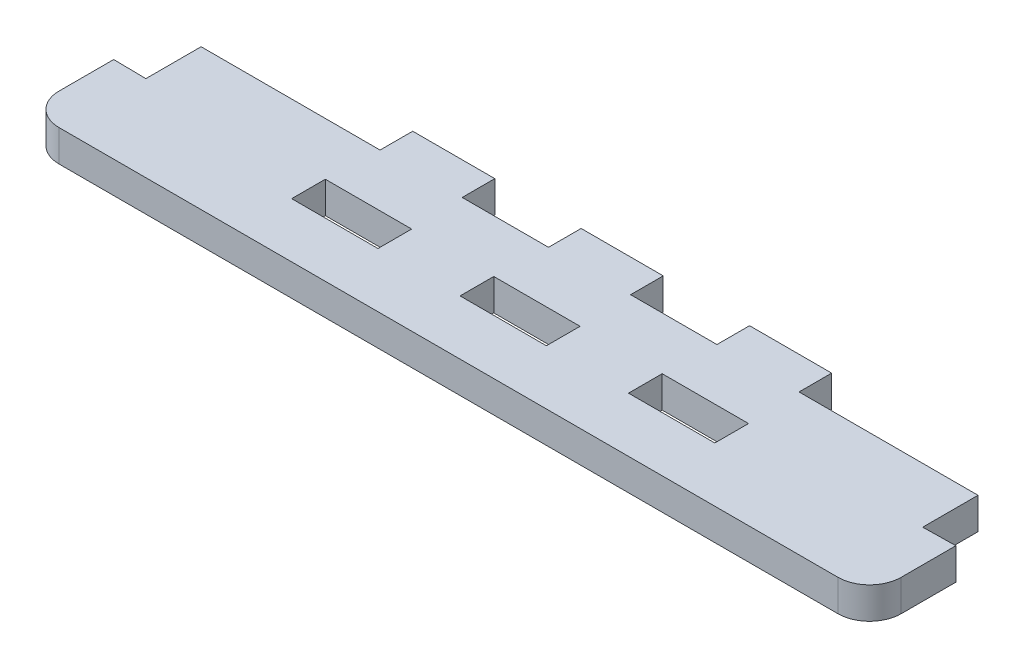
ISO-10303-21;
HEADER;
FILE_DESCRIPTION(('STEP AP214'),'2;1');
FILE_NAME('part.step','',(''),(''),'','','');
FILE_SCHEMA(('AUTOMOTIVE_DESIGN { 1 0 10303 214 1 1 1 1 }'));
ENDSEC;
DATA;
#1=APPLICATION_CONTEXT('core data for automotive mechanical design processes');
#2=APPLICATION_PROTOCOL_DEFINITION('international standard','automotive_design',2000,#1);
#3=PRODUCT_CONTEXT('',#1,'mechanical');
#4=PRODUCT('Part','Part','',(#3));
#5=PRODUCT_RELATED_PRODUCT_CATEGORY('part','',(#4));
#6=PRODUCT_DEFINITION_FORMATION('','',#4);
#7=PRODUCT_DEFINITION_CONTEXT('part definition',#1,'design');
#8=PRODUCT_DEFINITION('design','',#6,#7);
#9=PRODUCT_DEFINITION_SHAPE('','',#8);
#10=(LENGTH_UNIT() NAMED_UNIT(*) SI_UNIT(.MILLI.,.METRE.));
#11=(NAMED_UNIT(*) PLANE_ANGLE_UNIT() SI_UNIT($,.RADIAN.));
#12=(NAMED_UNIT(*) SI_UNIT($,.STERADIAN.) SOLID_ANGLE_UNIT());
#13=UNCERTAINTY_MEASURE_WITH_UNIT(LENGTH_MEASURE(1.E-05),#10,'distance_accuracy_value','');
#14=(GEOMETRIC_REPRESENTATION_CONTEXT(3) GLOBAL_UNCERTAINTY_ASSIGNED_CONTEXT((#13)) GLOBAL_UNIT_ASSIGNED_CONTEXT((#10,
#11,#12)) REPRESENTATION_CONTEXT('',''));
#15=CARTESIAN_POINT('',(0.,0.,0.));
#16=DIRECTION('',(0.,0.,1.));
#17=DIRECTION('',(1.,0.,0.));
#18=AXIS2_PLACEMENT_3D('',#15,#16,#17);
#19=CARTESIAN_POINT('',(0.,-3.,0.));
#20=DIRECTION('',(0.,0.,-1.));
#21=DIRECTION('',(-1.,0.,0.));
#22=AXIS2_PLACEMENT_3D('',#19,#20,#21);
#23=PLANE('',#22);
#24=DIRECTION('',(0.,1.,0.));
#25=VECTOR('',#24,1.);
#26=CARTESIAN_POINT('',(59.9000000000001,-3.,0.));
#27=LINE('',#26,#25);
#28=CARTESIAN_POINT('',(59.9000000000001,-3.,0.));
#29=VERTEX_POINT('',#28);
#30=CARTESIAN_POINT('',(59.9000000000001,0.,0.));
#31=VERTEX_POINT('',#30);
#32=EDGE_CURVE('E330',#29,#31,#27,.T.);
#33=ORIENTED_EDGE('',*,*,#32,.F.);
#34=DIRECTION('',(-1.,0.,0.));
#35=VECTOR('',#34,1.);
#36=CARTESIAN_POINT('',(0.,-3.,0.));
#37=LINE('',#36,#35);
#38=CARTESIAN_POINT('',(52.1000000000001,-3.,0.));
#39=VERTEX_POINT('',#38);
#40=EDGE_CURVE('E487',#29,#39,#37,.T.);
#41=ORIENTED_EDGE('',*,*,#40,.T.);
#42=DIRECTION('',(0.,-1.,0.));
#43=VECTOR('',#42,1.);
#44=CARTESIAN_POINT('',(52.1000000000001,-3.,0.));
#45=LINE('',#44,#43);
#46=CARTESIAN_POINT('',(52.1000000000001,0.,0.));
#47=VERTEX_POINT('',#46);
#48=EDGE_CURVE('E354',#47,#39,#45,.T.);
#49=ORIENTED_EDGE('',*,*,#48,.F.);
#50=DIRECTION('',(-1.,0.,0.));
#51=VECTOR('',#50,1.);
#52=CARTESIAN_POINT('',(0.,0.,0.));
#53=LINE('',#52,#51);
#54=EDGE_CURVE('E481',#31,#47,#53,.T.);
#55=ORIENTED_EDGE('',*,*,#54,.F.);
#56=EDGE_LOOP('',(#33,#41,#49,#55));
#57=FACE_BOUND('',#56,.T.);
#58=ADVANCED_FACE('F33',(#57),#23,.T.);
#59=DIRECTION('',(0.,1.,0.));
#60=VECTOR('',#59,1.);
#61=CARTESIAN_POINT('',(43.9,-3.,0.));
#62=LINE('',#61,#60);
#63=CARTESIAN_POINT('',(43.9,-3.,0.));
#64=VERTEX_POINT('',#63);
#65=CARTESIAN_POINT('',(43.9,0.,0.));
#66=VERTEX_POINT('',#65);
#67=EDGE_CURVE('E350',#64,#66,#62,.T.);
#68=ORIENTED_EDGE('',*,*,#67,.F.);
#69=CARTESIAN_POINT('',(36.1,-3.,0.));
#70=VERTEX_POINT('',#69);
#71=EDGE_CURVE('E490',#64,#70,#37,.T.);
#72=ORIENTED_EDGE('',*,*,#71,.T.);
#73=DIRECTION('',(0.,-1.,0.));
#74=VECTOR('',#73,1.);
#75=CARTESIAN_POINT('',(36.1,-3.,0.));
#76=LINE('',#75,#74);
#77=CARTESIAN_POINT('',(36.1,0.,0.));
#78=VERTEX_POINT('',#77);
#79=EDGE_CURVE('E411',#78,#70,#76,.T.);
#80=ORIENTED_EDGE('',*,*,#79,.F.);
#81=EDGE_CURVE('E500',#66,#78,#53,.T.);
#82=ORIENTED_EDGE('',*,*,#81,.F.);
#83=EDGE_LOOP('',(#68,#72,#80,#82));
#84=FACE_BOUND('',#83,.T.);
#85=ADVANCED_FACE('F565',(#84),#23,.T.);
#86=CARTESIAN_POINT('',(0.,-3.,0.));
#87=DIRECTION('',(-1.,0.,0.));
#88=DIRECTION('',(0.,0.,1.));
#89=AXIS2_PLACEMENT_3D('',#86,#87,#88);
#90=PLANE('',#89);
#91=DIRECTION('',(0.,0.,1.));
#92=VECTOR('',#91,1.);
#93=CARTESIAN_POINT('',(0.,-3.,0.));
#94=LINE('',#93,#92);
#95=CARTESIAN_POINT('',(0.,-3.,8.30001388792448));
#96=VERTEX_POINT('',#95);
#97=CARTESIAN_POINT('',(0.,-3.,13.5));
#98=VERTEX_POINT('',#97);
#99=EDGE_CURVE('E279',#96,#98,#94,.T.);
#100=ORIENTED_EDGE('',*,*,#99,.T.);
#101=DIRECTION('',(0.,1.,0.));
#102=VECTOR('',#101,1.);
#103=CARTESIAN_POINT('',(0.,-3.,13.5));
#104=LINE('',#103,#102);
#105=CARTESIAN_POINT('',(0.,0.,13.5));
#106=VERTEX_POINT('',#105);
#107=EDGE_CURVE('E11',#98,#106,#104,.T.);
#108=ORIENTED_EDGE('',*,*,#107,.T.);
#109=DIRECTION('',(0.,0.,1.));
#110=VECTOR('',#109,1.);
#111=CARTESIAN_POINT('',(0.,0.,0.));
#112=LINE('',#111,#110);
#113=CARTESIAN_POINT('',(0.,0.,8.30001388792448));
#114=VERTEX_POINT('',#113);
#115=EDGE_CURVE('E472',#114,#106,#112,.T.);
#116=ORIENTED_EDGE('',*,*,#115,.F.);
#117=DIRECTION('',(0.,1.,0.));
#118=VECTOR('',#117,1.);
#119=CARTESIAN_POINT('',(0.,-3.,8.30001388792448));
#120=LINE('',#119,#118);
#121=EDGE_CURVE('E294',#96,#114,#120,.T.);
#122=ORIENTED_EDGE('',*,*,#121,.F.);
#123=EDGE_LOOP('',(#100,#108,#116,#122));
#124=FACE_BOUND('',#123,.T.);
#125=ADVANCED_FACE('F608',(#124),#90,.T.);
#126=DIRECTION('',(0.,-1.,0.));
#127=VECTOR('',#126,1.);
#128=CARTESIAN_POINT('',(20.1,-3.,0.));
#129=LINE('',#128,#127);
#130=CARTESIAN_POINT('',(20.1,0.,0.));
#131=VERTEX_POINT('',#130);
#132=CARTESIAN_POINT('',(20.1,-3.,0.));
#133=VERTEX_POINT('',#132);
#134=EDGE_CURVE('E297',#131,#133,#129,.T.);
#135=ORIENTED_EDGE('',*,*,#134,.F.);
#136=CARTESIAN_POINT('',(27.9,0.,0.));
#137=VERTEX_POINT('',#136);
#138=EDGE_CURVE('E498',#137,#131,#53,.T.);
#139=ORIENTED_EDGE('',*,*,#138,.F.);
#140=DIRECTION('',(0.,1.,0.));
#141=VECTOR('',#140,1.);
#142=CARTESIAN_POINT('',(27.9,-3.,0.));
#143=LINE('',#142,#141);
#144=CARTESIAN_POINT('',(27.9,-3.,0.));
#145=VERTEX_POINT('',#144);
#146=EDGE_CURVE('E407',#145,#137,#143,.T.);
#147=ORIENTED_EDGE('',*,*,#146,.F.);
#148=EDGE_CURVE('E486',#145,#133,#37,.T.);
#149=ORIENTED_EDGE('',*,*,#148,.T.);
#150=EDGE_LOOP('',(#135,#139,#147,#149));
#151=FACE_BOUND('',#150,.T.);
#152=ADVANCED_FACE('F573',(#151),#23,.T.);
#153=CARTESIAN_POINT('',(80.,-3.,0.));
#154=DIRECTION('',(1.,0.,0.));
#155=DIRECTION('',(0.,0.,-1.));
#156=AXIS2_PLACEMENT_3D('',#153,#154,#155);
#157=PLANE('',#156);
#158=DIRECTION('',(0.,0.,-1.));
#159=VECTOR('',#158,1.);
#160=CARTESIAN_POINT('',(80.,0.,0.));
#161=LINE('',#160,#159);
#162=CARTESIAN_POINT('',(80.,0.,13.5));
#163=VERTEX_POINT('',#162);
#164=CARTESIAN_POINT('',(80.,0.,8.30001388792448));
#165=VERTEX_POINT('',#164);
#166=EDGE_CURVE('E496',#163,#165,#161,.T.);
#167=ORIENTED_EDGE('',*,*,#166,.F.);
#168=DIRECTION('',(0.,1.,0.));
#169=VECTOR('',#168,1.);
#170=CARTESIAN_POINT('',(80.,-3.,13.5));
#171=LINE('',#170,#169);
#172=CARTESIAN_POINT('',(80.,-3.,13.5));
#173=VERTEX_POINT('',#172);
#174=EDGE_CURVE('E56',#163,#173,#171,.F.);
#175=ORIENTED_EDGE('',*,*,#174,.T.);
#176=DIRECTION('',(0.,0.,-1.));
#177=VECTOR('',#176,1.);
#178=CARTESIAN_POINT('',(80.,-3.,0.));
#179=LINE('',#178,#177);
#180=CARTESIAN_POINT('',(80.,-3.,8.30001388792448));
#181=VERTEX_POINT('',#180);
#182=EDGE_CURVE('E484',#173,#181,#179,.T.);
#183=ORIENTED_EDGE('',*,*,#182,.T.);
#184=DIRECTION('',(0.,-1.,0.));
#185=VECTOR('',#184,1.);
#186=CARTESIAN_POINT('',(80.,-3.,8.30001388792448));
#187=LINE('',#186,#185);
#188=EDGE_CURVE('E323',#165,#181,#187,.T.);
#189=ORIENTED_EDGE('',*,*,#188,.F.);
#190=EDGE_LOOP('',(#167,#175,#183,#189));
#191=FACE_BOUND('',#190,.T.);
#192=ADVANCED_FACE('F530',(#191),#157,.T.);
#193=CARTESIAN_POINT('',(0.,-3.,16.5));
#194=DIRECTION('',(0.,0.,1.));
#195=DIRECTION('',(1.,0.,0.));
#196=AXIS2_PLACEMENT_3D('',#193,#194,#195);
#197=PLANE('',#196);
#198=DIRECTION('',(1.,0.,0.));
#199=VECTOR('',#198,1.);
#200=CARTESIAN_POINT('',(0.,-3.,16.5));
#201=LINE('',#200,#199);
#202=CARTESIAN_POINT('',(3.,-3.,16.5));
#203=VERTEX_POINT('',#202);
#204=CARTESIAN_POINT('',(77.,-3.,16.5));
#205=VERTEX_POINT('',#204);
#206=EDGE_CURVE('E480',#203,#205,#201,.T.);
#207=ORIENTED_EDGE('',*,*,#206,.T.);
#208=DIRECTION('',(0.,1.,0.));
#209=VECTOR('',#208,1.);
#210=CARTESIAN_POINT('',(77.,-3.,16.5));
#211=LINE('',#210,#209);
#212=CARTESIAN_POINT('',(77.,0.,16.5));
#213=VERTEX_POINT('',#212);
#214=EDGE_CURVE('E509',#205,#213,#211,.T.);
#215=ORIENTED_EDGE('',*,*,#214,.T.);
#216=DIRECTION('',(1.,0.,0.));
#217=VECTOR('',#216,1.);
#218=CARTESIAN_POINT('',(0.,0.,16.5));
#219=LINE('',#218,#217);
#220=CARTESIAN_POINT('',(3.,0.,16.5));
#221=VERTEX_POINT('',#220);
#222=EDGE_CURVE('E493',#221,#213,#219,.T.);
#223=ORIENTED_EDGE('',*,*,#222,.F.);
#224=DIRECTION('',(0.,1.,0.));
#225=VECTOR('',#224,1.);
#226=CARTESIAN_POINT('',(3.,-3.,16.5));
#227=LINE('',#226,#225);
#228=EDGE_CURVE('E507',#221,#203,#227,.F.);
#229=ORIENTED_EDGE('',*,*,#228,.T.);
#230=EDGE_LOOP('',(#207,#215,#223,#229));
#231=FACE_BOUND('',#230,.T.);
#232=ADVANCED_FACE('F521',(#231),#197,.T.);
#233=CARTESIAN_POINT('',(0.,-3.,0.));
#234=DIRECTION('',(0.,1.,0.));
#235=DIRECTION('',(0.,0.,1.));
#236=AXIS2_PLACEMENT_3D('',#233,#234,#235);
#237=PLANE('',#236);
#238=ORIENTED_EDGE('',*,*,#182,.F.);
#239=CARTESIAN_POINT('',(77.,-3.,13.5));
#240=DIRECTION('',(0.,1.,0.));
#241=DIRECTION('',(0.,0.,1.));
#242=AXIS2_PLACEMENT_3D('',#239,#240,#241);
#243=CIRCLE('',#242,3.);
#244=EDGE_CURVE('E41',#173,#205,#243,.F.);
#245=ORIENTED_EDGE('',*,*,#244,.T.);
#246=ORIENTED_EDGE('',*,*,#206,.F.);
#247=CARTESIAN_POINT('',(3.,-3.,13.5));
#248=DIRECTION('',(0.,1.,0.));
#249=DIRECTION('',(0.,0.,1.));
#250=AXIS2_PLACEMENT_3D('',#247,#248,#249);
#251=CIRCLE('',#250,3.);
#252=EDGE_CURVE('E48',#203,#98,#251,.F.);
#253=ORIENTED_EDGE('',*,*,#252,.T.);
#254=ORIENTED_EDGE('',*,*,#99,.F.);
#255=DIRECTION('',(0.9998611400396,0.,0.0166643523339989));
#256=VECTOR('',#255,1.);
#257=CARTESIAN_POINT('',(-0.1,-3.,8.29834722125781));
#258=LINE('',#257,#256);
#259=CARTESIAN_POINT('',(3.10000000000001,-3.,8.35168055459116));
#260=VERTEX_POINT('',#259);
#261=EDGE_CURVE('E260',#96,#260,#258,.T.);
#262=ORIENTED_EDGE('',*,*,#261,.T.);
#263=DIRECTION('',(0.,0.,-1.));
#264=VECTOR('',#263,1.);
#265=CARTESIAN_POINT('',(3.10000000000001,-3.,8.35168055459116));
#266=LINE('',#265,#264);
#267=CARTESIAN_POINT('',(3.10000000000001,-3.,3.09999999999999));
#268=VERTEX_POINT('',#267);
#269=EDGE_CURVE('E271',#260,#268,#266,.T.);
#270=ORIENTED_EDGE('',*,*,#269,.T.);
#271=DIRECTION('',(1.,0.,0.));
#272=VECTOR('',#271,1.);
#273=CARTESIAN_POINT('',(3.10000000000001,-3.,3.09999999999999));
#274=LINE('',#273,#272);
#275=CARTESIAN_POINT('',(20.1,-3.,3.09999999999999));
#276=VERTEX_POINT('',#275);
#277=EDGE_CURVE('E275',#268,#276,#274,.T.);
#278=ORIENTED_EDGE('',*,*,#277,.T.);
#279=DIRECTION('',(0.,0.,-1.));
#280=VECTOR('',#279,1.);
#281=CARTESIAN_POINT('',(20.1,-3.,3.09999999999999));
#282=LINE('',#281,#280);
#283=EDGE_CURVE('E268',#276,#133,#282,.T.);
#284=ORIENTED_EDGE('',*,*,#283,.T.);
#285=ORIENTED_EDGE('',*,*,#148,.F.);
#286=DIRECTION('',(0.,0.,1.));
#287=VECTOR('',#286,1.);
#288=CARTESIAN_POINT('',(27.9,-3.,-0.100000000000007));
#289=LINE('',#288,#287);
#290=CARTESIAN_POINT('',(27.9,-3.,3.09999999999999));
#291=VERTEX_POINT('',#290);
#292=EDGE_CURVE('E390',#145,#291,#289,.T.);
#293=ORIENTED_EDGE('',*,*,#292,.T.);
#294=DIRECTION('',(1.,0.,0.));
#295=VECTOR('',#294,1.);
#296=CARTESIAN_POINT('',(27.9,-3.,3.09999999999999));
#297=LINE('',#296,#295);
#298=CARTESIAN_POINT('',(36.1,-3.,3.09999999999999));
#299=VERTEX_POINT('',#298);
#300=EDGE_CURVE('E393',#291,#299,#297,.T.);
#301=ORIENTED_EDGE('',*,*,#300,.T.);
#302=DIRECTION('',(0.,0.,-1.));
#303=VECTOR('',#302,1.);
#304=CARTESIAN_POINT('',(36.1,-3.,3.09999999999999));
#305=LINE('',#304,#303);
#306=EDGE_CURVE('E397',#299,#70,#305,.T.);
#307=ORIENTED_EDGE('',*,*,#306,.T.);
#308=ORIENTED_EDGE('',*,*,#71,.F.);
#309=DIRECTION('',(0.,0.,1.));
#310=VECTOR('',#309,1.);
#311=CARTESIAN_POINT('',(43.9,-3.,-0.100000000000007));
#312=LINE('',#311,#310);
#313=CARTESIAN_POINT('',(43.9,-3.,3.09999999999999));
#314=VERTEX_POINT('',#313);
#315=EDGE_CURVE('E333',#64,#314,#312,.T.);
#316=ORIENTED_EDGE('',*,*,#315,.T.);
#317=DIRECTION('',(1.,0.,0.));
#318=VECTOR('',#317,1.);
#319=CARTESIAN_POINT('',(43.9,-3.,3.09999999999999));
#320=LINE('',#319,#318);
#321=CARTESIAN_POINT('',(52.1000000000001,-3.,3.09999999999999));
#322=VERTEX_POINT('',#321);
#323=EDGE_CURVE('E336',#314,#322,#320,.T.);
#324=ORIENTED_EDGE('',*,*,#323,.T.);
#325=DIRECTION('',(0.,0.,-1.));
#326=VECTOR('',#325,1.);
#327=CARTESIAN_POINT('',(52.1000000000001,-3.,3.09999999999999));
#328=LINE('',#327,#326);
#329=EDGE_CURVE('E340',#322,#39,#328,.T.);
#330=ORIENTED_EDGE('',*,*,#329,.T.);
#331=ORIENTED_EDGE('',*,*,#40,.F.);
#332=DIRECTION('',(0.,0.,1.));
#333=VECTOR('',#332,1.);
#334=CARTESIAN_POINT('',(59.9000000000001,-3.,-0.100000000000035));
#335=LINE('',#334,#333);
#336=CARTESIAN_POINT('',(59.9000000000001,-3.,3.09999999999999));
#337=VERTEX_POINT('',#336);
#338=EDGE_CURVE('E310',#29,#337,#335,.T.);
#339=ORIENTED_EDGE('',*,*,#338,.T.);
#340=DIRECTION('',(1.,0.,0.));
#341=VECTOR('',#340,1.);
#342=CARTESIAN_POINT('',(59.9000000000001,-3.,3.09999999999999));
#343=LINE('',#342,#341);
#344=CARTESIAN_POINT('',(76.9,-3.,3.09999999999999));
#345=VERTEX_POINT('',#344);
#346=EDGE_CURVE('E300',#337,#345,#343,.T.);
#347=ORIENTED_EDGE('',*,*,#346,.T.);
#348=DIRECTION('',(0.,0.,1.));
#349=VECTOR('',#348,1.);
#350=CARTESIAN_POINT('',(76.9,-3.,3.09999999999999));
#351=LINE('',#350,#349);
#352=CARTESIAN_POINT('',(76.9,-3.,8.35168055459116));
#353=VERTEX_POINT('',#352);
#354=EDGE_CURVE('E303',#345,#353,#351,.T.);
#355=ORIENTED_EDGE('',*,*,#354,.T.);
#356=DIRECTION('',(0.9998611400396,0.,-0.0166643523339984));
#357=VECTOR('',#356,1.);
#358=CARTESIAN_POINT('',(76.9,-3.,8.35168055459116));
#359=LINE('',#358,#357);
#360=EDGE_CURVE('E307',#353,#181,#359,.T.);
#361=ORIENTED_EDGE('',*,*,#360,.T.);
#362=EDGE_LOOP('',(#238,#245,#246,#253,#254,#262,#270,#278,#284,#285,#293,#301,#307,#308,#316,
#324,#330,#331,#339,#347,#355,#361));
#363=FACE_BOUND('',#362,.T.);
#364=DIRECTION('',(0.,0.,1.));
#365=VECTOR('',#364,1.);
#366=CARTESIAN_POINT('',(51.9,-3.,8.09999999999996));
#367=LINE('',#366,#365);
#368=CARTESIAN_POINT('',(51.9,-3.,8.09999999999996));
#369=VERTEX_POINT('',#368);
#370=CARTESIAN_POINT('',(51.9,-3.,11.3));
#371=VERTEX_POINT('',#370);
#372=EDGE_CURVE('E368',#369,#371,#367,.T.);
#373=ORIENTED_EDGE('',*,*,#372,.T.);
#374=DIRECTION('',(1.,0.,0.));
#375=VECTOR('',#374,1.);
#376=CARTESIAN_POINT('',(51.9,-3.,11.3));
#377=LINE('',#376,#375);
#378=CARTESIAN_POINT('',(60.1000000000001,-3.,11.3));
#379=VERTEX_POINT('',#378);
#380=EDGE_CURVE('E358',#371,#379,#377,.T.);
#381=ORIENTED_EDGE('',*,*,#380,.T.);
#382=DIRECTION('',(0.,0.,-1.));
#383=VECTOR('',#382,1.);
#384=CARTESIAN_POINT('',(60.1000000000001,-3.,11.3));
#385=LINE('',#384,#383);
#386=CARTESIAN_POINT('',(60.1000000000001,-3.,8.09999999999996));
#387=VERTEX_POINT('',#386);
#388=EDGE_CURVE('E361',#379,#387,#385,.T.);
#389=ORIENTED_EDGE('',*,*,#388,.T.);
#390=DIRECTION('',(-1.,0.,0.));
#391=VECTOR('',#390,1.);
#392=CARTESIAN_POINT('',(60.1000000000001,-3.,8.09999999999996));
#393=LINE('',#392,#391);
#394=EDGE_CURVE('E365',#387,#369,#393,.T.);
#395=ORIENTED_EDGE('',*,*,#394,.T.);
#396=EDGE_LOOP('',(#373,#381,#389,#395));
#397=FACE_BOUND('',#396,.T.);
#398=DIRECTION('',(0.,0.,-1.));
#399=VECTOR('',#398,1.);
#400=CARTESIAN_POINT('',(44.1,-3.,11.3));
#401=LINE('',#400,#399);
#402=CARTESIAN_POINT('',(44.1,-3.,11.3));
#403=VERTEX_POINT('',#402);
#404=CARTESIAN_POINT('',(44.1,-3.,8.09999999999996));
#405=VERTEX_POINT('',#404);
#406=EDGE_CURVE('E425',#403,#405,#401,.T.);
#407=ORIENTED_EDGE('',*,*,#406,.T.);
#408=DIRECTION('',(-1.,0.,0.));
#409=VECTOR('',#408,1.);
#410=CARTESIAN_POINT('',(44.1,-3.,8.09999999999996));
#411=LINE('',#410,#409);
#412=CARTESIAN_POINT('',(35.9,-3.,8.09999999999996));
#413=VERTEX_POINT('',#412);
#414=EDGE_CURVE('E415',#405,#413,#411,.T.);
#415=ORIENTED_EDGE('',*,*,#414,.T.);
#416=DIRECTION('',(0.,0.,1.));
#417=VECTOR('',#416,1.);
#418=CARTESIAN_POINT('',(35.9,-3.,8.09999999999996));
#419=LINE('',#418,#417);
#420=CARTESIAN_POINT('',(35.9,-3.,11.3));
#421=VERTEX_POINT('',#420);
#422=EDGE_CURVE('E418',#413,#421,#419,.T.);
#423=ORIENTED_EDGE('',*,*,#422,.T.);
#424=DIRECTION('',(1.,0.,0.));
#425=VECTOR('',#424,1.);
#426=CARTESIAN_POINT('',(35.9,-3.,11.3));
#427=LINE('',#426,#425);
#428=EDGE_CURVE('E422',#421,#403,#427,.T.);
#429=ORIENTED_EDGE('',*,*,#428,.T.);
#430=EDGE_LOOP('',(#407,#415,#423,#429));
#431=FACE_BOUND('',#430,.T.);
#432=DIRECTION('',(0.,0.,-1.));
#433=VECTOR('',#432,1.);
#434=CARTESIAN_POINT('',(28.1,-3.,11.3));
#435=LINE('',#434,#433);
#436=CARTESIAN_POINT('',(28.1,-3.,11.3));
#437=VERTEX_POINT('',#436);
#438=CARTESIAN_POINT('',(28.1,-3.,8.09999999999996));
#439=VERTEX_POINT('',#438);
#440=EDGE_CURVE('E457',#437,#439,#435,.T.);
#441=ORIENTED_EDGE('',*,*,#440,.T.);
#442=DIRECTION('',(-1.,0.,0.));
#443=VECTOR('',#442,1.);
#444=CARTESIAN_POINT('',(28.1,-3.,8.09999999999996));
#445=LINE('',#444,#443);
#446=CARTESIAN_POINT('',(19.9,-3.,8.09999999999996));
#447=VERTEX_POINT('',#446);
#448=EDGE_CURVE('E447',#439,#447,#445,.T.);
#449=ORIENTED_EDGE('',*,*,#448,.T.);
#450=DIRECTION('',(0.,0.,1.));
#451=VECTOR('',#450,1.);
#452=CARTESIAN_POINT('',(19.9,-3.,8.09999999999996));
#453=LINE('',#452,#451);
#454=CARTESIAN_POINT('',(19.9,-3.,11.3));
#455=VERTEX_POINT('',#454);
#456=EDGE_CURVE('E450',#447,#455,#453,.T.);
#457=ORIENTED_EDGE('',*,*,#456,.T.);
#458=DIRECTION('',(1.,0.,0.));
#459=VECTOR('',#458,1.);
#460=CARTESIAN_POINT('',(19.9,-3.,11.3));
#461=LINE('',#460,#459);
#462=EDGE_CURVE('E454',#455,#437,#461,.T.);
#463=ORIENTED_EDGE('',*,*,#462,.T.);
#464=EDGE_LOOP('',(#441,#449,#457,#463));
#465=FACE_BOUND('',#464,.T.);
#466=ADVANCED_FACE('F277',(#363,#397,#431,#465),#237,.F.);
#467=CARTESIAN_POINT('',(0.,0.,0.));
#468=DIRECTION('',(0.,1.,0.));
#469=DIRECTION('',(0.,0.,1.));
#470=AXIS2_PLACEMENT_3D('',#467,#468,#469);
#471=PLANE('',#470);
#472=ORIENTED_EDGE('',*,*,#222,.T.);
#473=CARTESIAN_POINT('',(77.,0.,13.5));
#474=DIRECTION('',(0.,1.,0.));
#475=DIRECTION('',(0.,0.,1.));
#476=AXIS2_PLACEMENT_3D('',#473,#474,#475);
#477=CIRCLE('',#476,3.);
#478=EDGE_CURVE('E514',#213,#163,#477,.T.);
#479=ORIENTED_EDGE('',*,*,#478,.T.);
#480=ORIENTED_EDGE('',*,*,#166,.T.);
#481=DIRECTION('',(0.9998611400396,0.,-0.0166643523339984));
#482=VECTOR('',#481,1.);
#483=CARTESIAN_POINT('',(76.9,0.,8.35168055459116));
#484=LINE('',#483,#482);
#485=CARTESIAN_POINT('',(76.9,0.,8.35168055459116));
#486=VERTEX_POINT('',#485);
#487=EDGE_CURVE('E304',#486,#165,#484,.T.);
#488=ORIENTED_EDGE('',*,*,#487,.F.);
#489=DIRECTION('',(0.,0.,1.));
#490=VECTOR('',#489,1.);
#491=CARTESIAN_POINT('',(76.9,0.,3.09999999999999));
#492=LINE('',#491,#490);
#493=CARTESIAN_POINT('',(76.9,0.,3.09999999999999));
#494=VERTEX_POINT('',#493);
#495=EDGE_CURVE('E315',#494,#486,#492,.T.);
#496=ORIENTED_EDGE('',*,*,#495,.F.);
#497=DIRECTION('',(1.,0.,0.));
#498=VECTOR('',#497,1.);
#499=CARTESIAN_POINT('',(59.9000000000001,0.,3.09999999999999));
#500=LINE('',#499,#498);
#501=CARTESIAN_POINT('',(59.9000000000001,0.,3.09999999999999));
#502=VERTEX_POINT('',#501);
#503=EDGE_CURVE('E299',#502,#494,#500,.T.);
#504=ORIENTED_EDGE('',*,*,#503,.F.);
#505=DIRECTION('',(0.,0.,1.));
#506=VECTOR('',#505,1.);
#507=CARTESIAN_POINT('',(59.9000000000001,0.,0.));
#508=LINE('',#507,#506);
#509=EDGE_CURVE('E504',#31,#502,#508,.T.);
#510=ORIENTED_EDGE('',*,*,#509,.F.);
#511=ORIENTED_EDGE('',*,*,#54,.T.);
#512=DIRECTION('',(0.,0.,-1.));
#513=VECTOR('',#512,1.);
#514=CARTESIAN_POINT('',(52.1000000000001,0.,3.09999999999999));
#515=LINE('',#514,#513);
#516=CARTESIAN_POINT('',(52.1000000000001,0.,3.09999999999999));
#517=VERTEX_POINT('',#516);
#518=EDGE_CURVE('E337',#517,#47,#515,.T.);
#519=ORIENTED_EDGE('',*,*,#518,.F.);
#520=DIRECTION('',(1.,0.,0.));
#521=VECTOR('',#520,1.);
#522=CARTESIAN_POINT('',(43.9,0.,3.09999999999999));
#523=LINE('',#522,#521);
#524=CARTESIAN_POINT('',(43.9,0.,3.09999999999999));
#525=VERTEX_POINT('',#524);
#526=EDGE_CURVE('E332',#525,#517,#523,.T.);
#527=ORIENTED_EDGE('',*,*,#526,.F.);
#528=DIRECTION('',(0.,0.,1.));
#529=VECTOR('',#528,1.);
#530=CARTESIAN_POINT('',(43.9,0.,0.));
#531=LINE('',#530,#529);
#532=EDGE_CURVE('E502',#66,#525,#531,.T.);
#533=ORIENTED_EDGE('',*,*,#532,.F.);
#534=ORIENTED_EDGE('',*,*,#81,.T.);
#535=DIRECTION('',(0.,0.,-1.));
#536=VECTOR('',#535,1.);
#537=CARTESIAN_POINT('',(36.1,0.,3.09999999999999));
#538=LINE('',#537,#536);
#539=CARTESIAN_POINT('',(36.1,0.,3.09999999999999));
#540=VERTEX_POINT('',#539);
#541=EDGE_CURVE('E394',#540,#78,#538,.T.);
#542=ORIENTED_EDGE('',*,*,#541,.F.);
#543=DIRECTION('',(1.,0.,0.));
#544=VECTOR('',#543,1.);
#545=CARTESIAN_POINT('',(27.9,0.,3.09999999999999));
#546=LINE('',#545,#544);
#547=CARTESIAN_POINT('',(27.9,0.,3.09999999999999));
#548=VERTEX_POINT('',#547);
#549=EDGE_CURVE('E383',#548,#540,#546,.T.);
#550=ORIENTED_EDGE('',*,*,#549,.F.);
#551=DIRECTION('',(0.,0.,1.));
#552=VECTOR('',#551,1.);
#553=CARTESIAN_POINT('',(27.9,0.,0.));
#554=LINE('',#553,#552);
#555=EDGE_CURVE('E489',#137,#548,#554,.T.);
#556=ORIENTED_EDGE('',*,*,#555,.F.);
#557=ORIENTED_EDGE('',*,*,#138,.T.);
#558=DIRECTION('',(0.,0.,-1.));
#559=VECTOR('',#558,1.);
#560=CARTESIAN_POINT('',(20.1,0.,3.09999999999999));
#561=LINE('',#560,#559);
#562=CARTESIAN_POINT('',(20.1,0.,3.09999999999999));
#563=VERTEX_POINT('',#562);
#564=EDGE_CURVE('E280',#563,#131,#561,.T.);
#565=ORIENTED_EDGE('',*,*,#564,.F.);
#566=DIRECTION('',(1.,0.,0.));
#567=VECTOR('',#566,1.);
#568=CARTESIAN_POINT('',(3.10000000000001,0.,3.09999999999999));
#569=LINE('',#568,#567);
#570=CARTESIAN_POINT('',(3.10000000000001,0.,3.09999999999999));
#571=VERTEX_POINT('',#570);
#572=EDGE_CURVE('E282',#571,#563,#569,.T.);
#573=ORIENTED_EDGE('',*,*,#572,.F.);
#574=DIRECTION('',(0.,0.,-1.));
#575=VECTOR('',#574,1.);
#576=CARTESIAN_POINT('',(3.10000000000001,0.,8.35168055459116));
#577=LINE('',#576,#575);
#578=CARTESIAN_POINT('',(3.10000000000001,0.,8.35168055459116));
#579=VERTEX_POINT('',#578);
#580=EDGE_CURVE('E288',#579,#571,#577,.T.);
#581=ORIENTED_EDGE('',*,*,#580,.F.);
#582=DIRECTION('',(0.9998611400396,0.,0.0166643523339989));
#583=VECTOR('',#582,1.);
#584=CARTESIAN_POINT('',(-0.138295149479488,0.,8.29770896876649));
#585=LINE('',#584,#583);
#586=EDGE_CURVE('E263',#114,#579,#585,.T.);
#587=ORIENTED_EDGE('',*,*,#586,.F.);
#588=ORIENTED_EDGE('',*,*,#115,.T.);
#589=CARTESIAN_POINT('',(3.,0.,13.5));
#590=DIRECTION('',(0.,1.,0.));
#591=DIRECTION('',(0.,0.,1.));
#592=AXIS2_PLACEMENT_3D('',#589,#590,#591);
#593=CIRCLE('',#592,3.);
#594=EDGE_CURVE('E512',#106,#221,#593,.T.);
#595=ORIENTED_EDGE('',*,*,#594,.T.);
#596=EDGE_LOOP('',(#472,#479,#480,#488,#496,#504,#510,#511,#519,#527,#533,#534,#542,#550,#556,
#557,#565,#573,#581,#587,#588,#595));
#597=FACE_BOUND('',#596,.T.);
#598=DIRECTION('',(1.,0.,0.));
#599=VECTOR('',#598,1.);
#600=CARTESIAN_POINT('',(51.9,0.,11.3));
#601=LINE('',#600,#599);
#602=CARTESIAN_POINT('',(51.9,0.,11.3));
#603=VERTEX_POINT('',#602);
#604=CARTESIAN_POINT('',(60.1000000000001,0.,11.3));
#605=VERTEX_POINT('',#604);
#606=EDGE_CURVE('E357',#603,#605,#601,.T.);
#607=ORIENTED_EDGE('',*,*,#606,.F.);
#608=DIRECTION('',(0.,0.,1.));
#609=VECTOR('',#608,1.);
#610=CARTESIAN_POINT('',(51.9,0.,8.09999999999996));
#611=LINE('',#610,#609);
#612=CARTESIAN_POINT('',(51.9,0.,8.09999999999996));
#613=VERTEX_POINT('',#612);
#614=EDGE_CURVE('E362',#613,#603,#611,.T.);
#615=ORIENTED_EDGE('',*,*,#614,.F.);
#616=DIRECTION('',(-1.,0.,0.));
#617=VECTOR('',#616,1.);
#618=CARTESIAN_POINT('',(60.1000000000001,0.,8.09999999999996));
#619=LINE('',#618,#617);
#620=CARTESIAN_POINT('',(60.1000000000001,0.,8.09999999999996));
#621=VERTEX_POINT('',#620);
#622=EDGE_CURVE('E376',#621,#613,#619,.T.);
#623=ORIENTED_EDGE('',*,*,#622,.F.);
#624=DIRECTION('',(0.,0.,-1.));
#625=VECTOR('',#624,1.);
#626=CARTESIAN_POINT('',(60.1000000000001,0.,11.3));
#627=LINE('',#626,#625);
#628=EDGE_CURVE('E373',#605,#621,#627,.T.);
#629=ORIENTED_EDGE('',*,*,#628,.F.);
#630=EDGE_LOOP('',(#607,#615,#623,#629));
#631=FACE_BOUND('',#630,.T.);
#632=DIRECTION('',(-1.,0.,0.));
#633=VECTOR('',#632,1.);
#634=CARTESIAN_POINT('',(44.1,0.,8.09999999999996));
#635=LINE('',#634,#633);
#636=CARTESIAN_POINT('',(44.1,0.,8.09999999999996));
#637=VERTEX_POINT('',#636);
#638=CARTESIAN_POINT('',(35.9,0.,8.09999999999996));
#639=VERTEX_POINT('',#638);
#640=EDGE_CURVE('E414',#637,#639,#635,.T.);
#641=ORIENTED_EDGE('',*,*,#640,.F.);
#642=DIRECTION('',(0.,0.,-1.));
#643=VECTOR('',#642,1.);
#644=CARTESIAN_POINT('',(44.1,0.,11.3));
#645=LINE('',#644,#643);
#646=CARTESIAN_POINT('',(44.1,0.,11.3));
#647=VERTEX_POINT('',#646);
#648=EDGE_CURVE('E419',#647,#637,#645,.T.);
#649=ORIENTED_EDGE('',*,*,#648,.F.);
#650=DIRECTION('',(1.,0.,0.));
#651=VECTOR('',#650,1.);
#652=CARTESIAN_POINT('',(35.9,0.,11.3));
#653=LINE('',#652,#651);
#654=CARTESIAN_POINT('',(35.9,0.,11.3));
#655=VERTEX_POINT('',#654);
#656=EDGE_CURVE('E433',#655,#647,#653,.T.);
#657=ORIENTED_EDGE('',*,*,#656,.F.);
#658=DIRECTION('',(0.,0.,1.));
#659=VECTOR('',#658,1.);
#660=CARTESIAN_POINT('',(35.9,0.,8.09999999999996));
#661=LINE('',#660,#659);
#662=EDGE_CURVE('E430',#639,#655,#661,.T.);
#663=ORIENTED_EDGE('',*,*,#662,.F.);
#664=EDGE_LOOP('',(#641,#649,#657,#663));
#665=FACE_BOUND('',#664,.T.);
#666=DIRECTION('',(-1.,0.,0.));
#667=VECTOR('',#666,1.);
#668=CARTESIAN_POINT('',(28.1,0.,8.09999999999996));
#669=LINE('',#668,#667);
#670=CARTESIAN_POINT('',(28.1,0.,8.09999999999996));
#671=VERTEX_POINT('',#670);
#672=CARTESIAN_POINT('',(19.9,0.,8.09999999999996));
#673=VERTEX_POINT('',#672);
#674=EDGE_CURVE('E440',#671,#673,#669,.T.);
#675=ORIENTED_EDGE('',*,*,#674,.F.);
#676=DIRECTION('',(0.,0.,-1.));
#677=VECTOR('',#676,1.);
#678=CARTESIAN_POINT('',(28.1,0.,11.3));
#679=LINE('',#678,#677);
#680=CARTESIAN_POINT('',(28.1,0.,11.3));
#681=VERTEX_POINT('',#680);
#682=EDGE_CURVE('E451',#681,#671,#679,.T.);
#683=ORIENTED_EDGE('',*,*,#682,.F.);
#684=DIRECTION('',(1.,0.,0.));
#685=VECTOR('',#684,1.);
#686=CARTESIAN_POINT('',(19.9,0.,11.3));
#687=LINE('',#686,#685);
#688=CARTESIAN_POINT('',(19.9,0.,11.3));
#689=VERTEX_POINT('',#688);
#690=EDGE_CURVE('E465',#689,#681,#687,.T.);
#691=ORIENTED_EDGE('',*,*,#690,.F.);
#692=DIRECTION('',(0.,0.,1.));
#693=VECTOR('',#692,1.);
#694=CARTESIAN_POINT('',(19.9,0.,8.09999999999996));
#695=LINE('',#694,#693);
#696=EDGE_CURVE('E462',#673,#689,#695,.T.);
#697=ORIENTED_EDGE('',*,*,#696,.F.);
#698=EDGE_LOOP('',(#675,#683,#691,#697));
#699=FACE_BOUND('',#698,.T.);
#700=ADVANCED_FACE('F526',(#597,#631,#665,#699),#471,.T.);
#701=CARTESIAN_POINT('',(28.1,-3.,8.09999999999996));
#702=DIRECTION('',(0.,0.,-1.));
#703=DIRECTION('',(-1.,0.,0.));
#704=AXIS2_PLACEMENT_3D('',#701,#702,#703);
#705=PLANE('',#704);
#706=ORIENTED_EDGE('',*,*,#674,.T.);
#707=DIRECTION('',(0.,1.,0.));
#708=VECTOR('',#707,1.);
#709=CARTESIAN_POINT('',(19.9,-3.,8.09999999999996));
#710=LINE('',#709,#708);
#711=EDGE_CURVE('E460',#447,#673,#710,.T.);
#712=ORIENTED_EDGE('',*,*,#711,.F.);
#713=ORIENTED_EDGE('',*,*,#448,.F.);
#714=DIRECTION('',(0.,1.,0.));
#715=VECTOR('',#714,1.);
#716=CARTESIAN_POINT('',(28.1,-3.,8.09999999999996));
#717=LINE('',#716,#715);
#718=EDGE_CURVE('E470',#439,#671,#717,.T.);
#719=ORIENTED_EDGE('',*,*,#718,.T.);
#720=EDGE_LOOP('',(#706,#712,#713,#719));
#721=FACE_BOUND('',#720,.T.);
#722=ADVANCED_FACE('F685',(#721),#705,.F.);
#723=CARTESIAN_POINT('',(28.1,-3.,11.3));
#724=DIRECTION('',(1.,0.,0.));
#725=DIRECTION('',(0.,0.,-1.));
#726=AXIS2_PLACEMENT_3D('',#723,#724,#725);
#727=PLANE('',#726);
#728=ORIENTED_EDGE('',*,*,#682,.T.);
#729=ORIENTED_EDGE('',*,*,#718,.F.);
#730=ORIENTED_EDGE('',*,*,#440,.F.);
#731=DIRECTION('',(0.,1.,0.));
#732=VECTOR('',#731,1.);
#733=CARTESIAN_POINT('',(28.1,-3.,11.3));
#734=LINE('',#733,#732);
#735=EDGE_CURVE('E473',#437,#681,#734,.T.);
#736=ORIENTED_EDGE('',*,*,#735,.T.);
#737=EDGE_LOOP('',(#728,#729,#730,#736));
#738=FACE_BOUND('',#737,.T.);
#739=ADVANCED_FACE('F681',(#738),#727,.F.);
#740=CARTESIAN_POINT('',(19.9,-3.,11.3));
#741=DIRECTION('',(0.,0.,1.));
#742=DIRECTION('',(1.,0.,0.));
#743=AXIS2_PLACEMENT_3D('',#740,#741,#742);
#744=PLANE('',#743);
#745=ORIENTED_EDGE('',*,*,#690,.T.);
#746=ORIENTED_EDGE('',*,*,#735,.F.);
#747=ORIENTED_EDGE('',*,*,#462,.F.);
#748=DIRECTION('',(0.,1.,0.));
#749=VECTOR('',#748,1.);
#750=CARTESIAN_POINT('',(19.9,-3.,11.3));
#751=LINE('',#750,#749);
#752=EDGE_CURVE('E475',#455,#689,#751,.T.);
#753=ORIENTED_EDGE('',*,*,#752,.T.);
#754=EDGE_LOOP('',(#745,#746,#747,#753));
#755=FACE_BOUND('',#754,.T.);
#756=ADVANCED_FACE('F684',(#755),#744,.F.);
#757=CARTESIAN_POINT('',(19.9,-3.,8.09999999999996));
#758=DIRECTION('',(-1.,0.,0.));
#759=DIRECTION('',(0.,0.,1.));
#760=AXIS2_PLACEMENT_3D('',#757,#758,#759);
#761=PLANE('',#760);
#762=ORIENTED_EDGE('',*,*,#696,.T.);
#763=ORIENTED_EDGE('',*,*,#752,.F.);
#764=ORIENTED_EDGE('',*,*,#456,.F.);
#765=ORIENTED_EDGE('',*,*,#711,.T.);
#766=EDGE_LOOP('',(#762,#763,#764,#765));
#767=FACE_BOUND('',#766,.T.);
#768=ADVANCED_FACE('F679',(#767),#761,.F.);
#769=CARTESIAN_POINT('',(44.1,-3.,8.09999999999996));
#770=DIRECTION('',(0.,0.,-1.));
#771=DIRECTION('',(-1.,0.,0.));
#772=AXIS2_PLACEMENT_3D('',#769,#770,#771);
#773=PLANE('',#772);
#774=ORIENTED_EDGE('',*,*,#640,.T.);
#775=DIRECTION('',(0.,1.,0.));
#776=VECTOR('',#775,1.);
#777=CARTESIAN_POINT('',(35.9,-3.,8.09999999999996));
#778=LINE('',#777,#776);
#779=EDGE_CURVE('E428',#413,#639,#778,.T.);
#780=ORIENTED_EDGE('',*,*,#779,.F.);
#781=ORIENTED_EDGE('',*,*,#414,.F.);
#782=DIRECTION('',(0.,1.,0.));
#783=VECTOR('',#782,1.);
#784=CARTESIAN_POINT('',(44.1,-3.,8.09999999999996));
#785=LINE('',#784,#783);
#786=EDGE_CURVE('E438',#405,#637,#785,.T.);
#787=ORIENTED_EDGE('',*,*,#786,.T.);
#788=EDGE_LOOP('',(#774,#780,#781,#787));
#789=FACE_BOUND('',#788,.T.);
#790=ADVANCED_FACE('F676',(#789),#773,.F.);
#791=CARTESIAN_POINT('',(44.1,-3.,11.3));
#792=DIRECTION('',(1.,0.,0.));
#793=DIRECTION('',(0.,0.,-1.));
#794=AXIS2_PLACEMENT_3D('',#791,#792,#793);
#795=PLANE('',#794);
#796=ORIENTED_EDGE('',*,*,#648,.T.);
#797=ORIENTED_EDGE('',*,*,#786,.F.);
#798=ORIENTED_EDGE('',*,*,#406,.F.);
#799=DIRECTION('',(0.,1.,0.));
#800=VECTOR('',#799,1.);
#801=CARTESIAN_POINT('',(44.1,-3.,11.3));
#802=LINE('',#801,#800);
#803=EDGE_CURVE('E441',#403,#647,#802,.T.);
#804=ORIENTED_EDGE('',*,*,#803,.T.);
#805=EDGE_LOOP('',(#796,#797,#798,#804));
#806=FACE_BOUND('',#805,.T.);
#807=ADVANCED_FACE('F672',(#806),#795,.F.);
#808=CARTESIAN_POINT('',(35.9,-3.,11.3));
#809=DIRECTION('',(0.,0.,1.));
#810=DIRECTION('',(1.,0.,0.));
#811=AXIS2_PLACEMENT_3D('',#808,#809,#810);
#812=PLANE('',#811);
#813=ORIENTED_EDGE('',*,*,#656,.T.);
#814=ORIENTED_EDGE('',*,*,#803,.F.);
#815=ORIENTED_EDGE('',*,*,#428,.F.);
#816=DIRECTION('',(0.,1.,0.));
#817=VECTOR('',#816,1.);
#818=CARTESIAN_POINT('',(35.9,-3.,11.3));
#819=LINE('',#818,#817);
#820=EDGE_CURVE('E443',#421,#655,#819,.T.);
#821=ORIENTED_EDGE('',*,*,#820,.T.);
#822=EDGE_LOOP('',(#813,#814,#815,#821));
#823=FACE_BOUND('',#822,.T.);
#824=ADVANCED_FACE('F666',(#823),#812,.F.);
#825=CARTESIAN_POINT('',(35.9,-3.,8.09999999999996));
#826=DIRECTION('',(-1.,0.,0.));
#827=DIRECTION('',(0.,0.,1.));
#828=AXIS2_PLACEMENT_3D('',#825,#826,#827);
#829=PLANE('',#828);
#830=ORIENTED_EDGE('',*,*,#662,.T.);
#831=ORIENTED_EDGE('',*,*,#820,.F.);
#832=ORIENTED_EDGE('',*,*,#422,.F.);
#833=ORIENTED_EDGE('',*,*,#779,.T.);
#834=EDGE_LOOP('',(#830,#831,#832,#833));
#835=FACE_BOUND('',#834,.T.);
#836=ADVANCED_FACE('F662',(#835),#829,.F.);
#837=CARTESIAN_POINT('',(36.1,-3.,3.09999999999999));
#838=DIRECTION('',(1.,0.,0.));
#839=DIRECTION('',(0.,0.,-1.));
#840=AXIS2_PLACEMENT_3D('',#837,#838,#839);
#841=PLANE('',#840);
#842=ORIENTED_EDGE('',*,*,#79,.T.);
#843=ORIENTED_EDGE('',*,*,#306,.F.);
#844=DIRECTION('',(0.,1.,0.));
#845=VECTOR('',#844,1.);
#846=CARTESIAN_POINT('',(36.1,-3.,3.09999999999999));
#847=LINE('',#846,#845);
#848=EDGE_CURVE('E405',#299,#540,#847,.T.);
#849=ORIENTED_EDGE('',*,*,#848,.T.);
#850=ORIENTED_EDGE('',*,*,#541,.T.);
#851=EDGE_LOOP('',(#842,#843,#849,#850));
#852=FACE_BOUND('',#851,.T.);
#853=ADVANCED_FACE('F585',(#852),#841,.F.);
#854=CARTESIAN_POINT('',(27.9,-3.,3.09999999999999));
#855=DIRECTION('',(0.,0.,1.));
#856=DIRECTION('',(1.,0.,0.));
#857=AXIS2_PLACEMENT_3D('',#854,#855,#856);
#858=PLANE('',#857);
#859=ORIENTED_EDGE('',*,*,#549,.T.);
#860=ORIENTED_EDGE('',*,*,#848,.F.);
#861=ORIENTED_EDGE('',*,*,#300,.F.);
#862=DIRECTION('',(0.,1.,0.));
#863=VECTOR('',#862,1.);
#864=CARTESIAN_POINT('',(27.9,-3.,3.09999999999999));
#865=LINE('',#864,#863);
#866=EDGE_CURVE('E400',#291,#548,#865,.T.);
#867=ORIENTED_EDGE('',*,*,#866,.T.);
#868=EDGE_LOOP('',(#859,#860,#861,#867));
#869=FACE_BOUND('',#868,.T.);
#870=ADVANCED_FACE('F588',(#869),#858,.F.);
#871=CARTESIAN_POINT('',(27.9,-3.,-0.100000000000007));
#872=DIRECTION('',(-1.,0.,0.));
#873=DIRECTION('',(0.,0.,1.));
#874=AXIS2_PLACEMENT_3D('',#871,#872,#873);
#875=PLANE('',#874);
#876=ORIENTED_EDGE('',*,*,#146,.T.);
#877=ORIENTED_EDGE('',*,*,#555,.T.);
#878=ORIENTED_EDGE('',*,*,#866,.F.);
#879=ORIENTED_EDGE('',*,*,#292,.F.);
#880=EDGE_LOOP('',(#876,#877,#878,#879));
#881=FACE_BOUND('',#880,.T.);
#882=ADVANCED_FACE('F590',(#881),#875,.F.);
#883=CARTESIAN_POINT('',(51.9,-3.,11.3));
#884=DIRECTION('',(0.,0.,1.));
#885=DIRECTION('',(1.,0.,0.));
#886=AXIS2_PLACEMENT_3D('',#883,#884,#885);
#887=PLANE('',#886);
#888=ORIENTED_EDGE('',*,*,#606,.T.);
#889=DIRECTION('',(0.,1.,0.));
#890=VECTOR('',#889,1.);
#891=CARTESIAN_POINT('',(60.1000000000001,-3.,11.3));
#892=LINE('',#891,#890);
#893=EDGE_CURVE('E371',#379,#605,#892,.T.);
#894=ORIENTED_EDGE('',*,*,#893,.F.);
#895=ORIENTED_EDGE('',*,*,#380,.F.);
#896=DIRECTION('',(0.,1.,0.));
#897=VECTOR('',#896,1.);
#898=CARTESIAN_POINT('',(51.9,-3.,11.3));
#899=LINE('',#898,#897);
#900=EDGE_CURVE('E381',#371,#603,#899,.T.);
#901=ORIENTED_EDGE('',*,*,#900,.T.);
#902=EDGE_LOOP('',(#888,#894,#895,#901));
#903=FACE_BOUND('',#902,.T.);
#904=ADVANCED_FACE('F592',(#903),#887,.F.);
#905=CARTESIAN_POINT('',(51.9,-3.,8.09999999999996));
#906=DIRECTION('',(-1.,0.,0.));
#907=DIRECTION('',(0.,0.,1.));
#908=AXIS2_PLACEMENT_3D('',#905,#906,#907);
#909=PLANE('',#908);
#910=ORIENTED_EDGE('',*,*,#614,.T.);
#911=ORIENTED_EDGE('',*,*,#900,.F.);
#912=ORIENTED_EDGE('',*,*,#372,.F.);
#913=DIRECTION('',(0.,1.,0.));
#914=VECTOR('',#913,1.);
#915=CARTESIAN_POINT('',(51.9,-3.,8.09999999999996));
#916=LINE('',#915,#914);
#917=EDGE_CURVE('E384',#369,#613,#916,.T.);
#918=ORIENTED_EDGE('',*,*,#917,.T.);
#919=EDGE_LOOP('',(#910,#911,#912,#918));
#920=FACE_BOUND('',#919,.T.);
#921=ADVANCED_FACE('F598',(#920),#909,.F.);
#922=CARTESIAN_POINT('',(60.1000000000001,-3.,8.09999999999996));
#923=DIRECTION('',(0.,0.,-1.));
#924=DIRECTION('',(-1.,0.,0.));
#925=AXIS2_PLACEMENT_3D('',#922,#923,#924);
#926=PLANE('',#925);
#927=ORIENTED_EDGE('',*,*,#622,.T.);
#928=ORIENTED_EDGE('',*,*,#917,.F.);
#929=ORIENTED_EDGE('',*,*,#394,.F.);
#930=DIRECTION('',(0.,1.,0.));
#931=VECTOR('',#930,1.);
#932=CARTESIAN_POINT('',(60.1000000000001,-3.,8.09999999999996));
#933=LINE('',#932,#931);
#934=EDGE_CURVE('E386',#387,#621,#933,.T.);
#935=ORIENTED_EDGE('',*,*,#934,.T.);
#936=EDGE_LOOP('',(#927,#928,#929,#935));
#937=FACE_BOUND('',#936,.T.);
#938=ADVANCED_FACE('F653',(#937),#926,.F.);
#939=CARTESIAN_POINT('',(60.1000000000001,-3.,11.3));
#940=DIRECTION('',(1.,0.,0.));
#941=DIRECTION('',(0.,0.,-1.));
#942=AXIS2_PLACEMENT_3D('',#939,#940,#941);
#943=PLANE('',#942);
#944=ORIENTED_EDGE('',*,*,#628,.T.);
#945=ORIENTED_EDGE('',*,*,#934,.F.);
#946=ORIENTED_EDGE('',*,*,#388,.F.);
#947=ORIENTED_EDGE('',*,*,#893,.T.);
#948=EDGE_LOOP('',(#944,#945,#946,#947));
#949=FACE_BOUND('',#948,.T.);
#950=ADVANCED_FACE('F646',(#949),#943,.F.);
#951=CARTESIAN_POINT('',(52.1000000000001,-3.,3.09999999999999));
#952=DIRECTION('',(1.,0.,0.));
#953=DIRECTION('',(0.,0.,-1.));
#954=AXIS2_PLACEMENT_3D('',#951,#952,#953);
#955=PLANE('',#954);
#956=ORIENTED_EDGE('',*,*,#48,.T.);
#957=ORIENTED_EDGE('',*,*,#329,.F.);
#958=DIRECTION('',(0.,1.,0.));
#959=VECTOR('',#958,1.);
#960=CARTESIAN_POINT('',(52.1000000000001,-3.,3.09999999999999));
#961=LINE('',#960,#959);
#962=EDGE_CURVE('E348',#322,#517,#961,.T.);
#963=ORIENTED_EDGE('',*,*,#962,.T.);
#964=ORIENTED_EDGE('',*,*,#518,.T.);
#965=EDGE_LOOP('',(#956,#957,#963,#964));
#966=FACE_BOUND('',#965,.T.);
#967=ADVANCED_FACE('F553',(#966),#955,.F.);
#968=CARTESIAN_POINT('',(43.9,-3.,3.09999999999999));
#969=DIRECTION('',(0.,0.,1.));
#970=DIRECTION('',(1.,0.,0.));
#971=AXIS2_PLACEMENT_3D('',#968,#969,#970);
#972=PLANE('',#971);
#973=ORIENTED_EDGE('',*,*,#526,.T.);
#974=ORIENTED_EDGE('',*,*,#962,.F.);
#975=ORIENTED_EDGE('',*,*,#323,.F.);
#976=DIRECTION('',(0.,1.,0.));
#977=VECTOR('',#976,1.);
#978=CARTESIAN_POINT('',(43.9,-3.,3.09999999999999));
#979=LINE('',#978,#977);
#980=EDGE_CURVE('E343',#314,#525,#979,.T.);
#981=ORIENTED_EDGE('',*,*,#980,.T.);
#982=EDGE_LOOP('',(#973,#974,#975,#981));
#983=FACE_BOUND('',#982,.T.);
#984=ADVANCED_FACE('F559',(#983),#972,.F.);
#985=CARTESIAN_POINT('',(43.9,-3.,-0.100000000000007));
#986=DIRECTION('',(-1.,0.,0.));
#987=DIRECTION('',(0.,0.,1.));
#988=AXIS2_PLACEMENT_3D('',#985,#986,#987);
#989=PLANE('',#988);
#990=ORIENTED_EDGE('',*,*,#67,.T.);
#991=ORIENTED_EDGE('',*,*,#532,.T.);
#992=ORIENTED_EDGE('',*,*,#980,.F.);
#993=ORIENTED_EDGE('',*,*,#315,.F.);
#994=EDGE_LOOP('',(#990,#991,#992,#993));
#995=FACE_BOUND('',#994,.T.);
#996=ADVANCED_FACE('F561',(#995),#989,.F.);
#997=CARTESIAN_POINT('',(59.9000000000001,-3.,3.09999999999999));
#998=DIRECTION('',(0.,0.,1.));
#999=DIRECTION('',(1.,0.,0.));
#1000=AXIS2_PLACEMENT_3D('',#997,#998,#999);
#1001=PLANE('',#1000);
#1002=ORIENTED_EDGE('',*,*,#503,.T.);
#1003=DIRECTION('',(0.,1.,0.));
#1004=VECTOR('',#1003,1.);
#1005=CARTESIAN_POINT('',(76.9,-3.,3.09999999999999));
#1006=LINE('',#1005,#1004);
#1007=EDGE_CURVE('E313',#345,#494,#1006,.T.);
#1008=ORIENTED_EDGE('',*,*,#1007,.F.);
#1009=ORIENTED_EDGE('',*,*,#346,.F.);
#1010=DIRECTION('',(0.,1.,0.));
#1011=VECTOR('',#1010,1.);
#1012=CARTESIAN_POINT('',(59.9000000000001,-3.,3.09999999999999));
#1013=LINE('',#1012,#1011);
#1014=EDGE_CURVE('E320',#337,#502,#1013,.T.);
#1015=ORIENTED_EDGE('',*,*,#1014,.T.);
#1016=EDGE_LOOP('',(#1002,#1008,#1009,#1015));
#1017=FACE_BOUND('',#1016,.T.);
#1018=ADVANCED_FACE('F543',(#1017),#1001,.F.);
#1019=CARTESIAN_POINT('',(59.9000000000001,-3.,-0.100000000000035));
#1020=DIRECTION('',(-1.,0.,0.));
#1021=DIRECTION('',(0.,0.,1.));
#1022=AXIS2_PLACEMENT_3D('',#1019,#1020,#1021);
#1023=PLANE('',#1022);
#1024=ORIENTED_EDGE('',*,*,#32,.T.);
#1025=ORIENTED_EDGE('',*,*,#509,.T.);
#1026=ORIENTED_EDGE('',*,*,#1014,.F.);
#1027=ORIENTED_EDGE('',*,*,#338,.F.);
#1028=EDGE_LOOP('',(#1024,#1025,#1026,#1027));
#1029=FACE_BOUND('',#1028,.T.);
#1030=ADVANCED_FACE('F545',(#1029),#1023,.F.);
#1031=CARTESIAN_POINT('',(76.9,-3.,8.35168055459116));
#1032=DIRECTION('',(0.0166643523339984,0.,0.9998611400396));
#1033=DIRECTION('',(0.9998611400396,0.,-0.0166643523339984));
#1034=AXIS2_PLACEMENT_3D('',#1031,#1032,#1033);
#1035=PLANE('',#1034);
#1036=ORIENTED_EDGE('',*,*,#188,.T.);
#1037=ORIENTED_EDGE('',*,*,#360,.F.);
#1038=DIRECTION('',(0.,1.,0.));
#1039=VECTOR('',#1038,1.);
#1040=CARTESIAN_POINT('',(76.9,-3.,8.35168055459116));
#1041=LINE('',#1040,#1039);
#1042=EDGE_CURVE('E324',#353,#486,#1041,.T.);
#1043=ORIENTED_EDGE('',*,*,#1042,.T.);
#1044=ORIENTED_EDGE('',*,*,#487,.T.);
#1045=EDGE_LOOP('',(#1036,#1037,#1043,#1044));
#1046=FACE_BOUND('',#1045,.T.);
#1047=ADVANCED_FACE('F533',(#1046),#1035,.F.);
#1048=CARTESIAN_POINT('',(76.9,-3.,3.09999999999999));
#1049=DIRECTION('',(-1.,0.,0.));
#1050=DIRECTION('',(0.,0.,1.));
#1051=AXIS2_PLACEMENT_3D('',#1048,#1049,#1050);
#1052=PLANE('',#1051);
#1053=ORIENTED_EDGE('',*,*,#495,.T.);
#1054=ORIENTED_EDGE('',*,*,#1042,.F.);
#1055=ORIENTED_EDGE('',*,*,#354,.F.);
#1056=ORIENTED_EDGE('',*,*,#1007,.T.);
#1057=EDGE_LOOP('',(#1053,#1054,#1055,#1056));
#1058=FACE_BOUND('',#1057,.T.);
#1059=ADVANCED_FACE('F537',(#1058),#1052,.F.);
#1060=CARTESIAN_POINT('',(20.1,-3.,3.09999999999999));
#1061=DIRECTION('',(1.,0.,0.));
#1062=DIRECTION('',(0.,0.,-1.));
#1063=AXIS2_PLACEMENT_3D('',#1060,#1061,#1062);
#1064=PLANE('',#1063);
#1065=ORIENTED_EDGE('',*,*,#134,.T.);
#1066=ORIENTED_EDGE('',*,*,#283,.F.);
#1067=DIRECTION('',(0.,1.,0.));
#1068=VECTOR('',#1067,1.);
#1069=CARTESIAN_POINT('',(20.1,-3.,3.09999999999999));
#1070=LINE('',#1069,#1068);
#1071=EDGE_CURVE('E292',#276,#563,#1070,.T.);
#1072=ORIENTED_EDGE('',*,*,#1071,.T.);
#1073=ORIENTED_EDGE('',*,*,#564,.T.);
#1074=EDGE_LOOP('',(#1065,#1066,#1072,#1073));
#1075=FACE_BOUND('',#1074,.T.);
#1076=ADVANCED_FACE('F578',(#1075),#1064,.F.);
#1077=CARTESIAN_POINT('',(3.10000000000001,-3.,3.09999999999999));
#1078=DIRECTION('',(0.,0.,1.));
#1079=DIRECTION('',(1.,0.,0.));
#1080=AXIS2_PLACEMENT_3D('',#1077,#1078,#1079);
#1081=PLANE('',#1080);
#1082=ORIENTED_EDGE('',*,*,#572,.T.);
#1083=ORIENTED_EDGE('',*,*,#1071,.F.);
#1084=ORIENTED_EDGE('',*,*,#277,.F.);
#1085=DIRECTION('',(0.,1.,0.));
#1086=VECTOR('',#1085,1.);
#1087=CARTESIAN_POINT('',(3.10000000000001,-3.,3.09999999999999));
#1088=LINE('',#1087,#1086);
#1089=EDGE_CURVE('E267',#268,#571,#1088,.T.);
#1090=ORIENTED_EDGE('',*,*,#1089,.T.);
#1091=EDGE_LOOP('',(#1082,#1083,#1084,#1090));
#1092=FACE_BOUND('',#1091,.T.);
#1093=ADVANCED_FACE('F632',(#1092),#1081,.F.);
#1094=CARTESIAN_POINT('',(3.10000000000001,-3.,8.35168055459116));
#1095=DIRECTION('',(1.,0.,0.));
#1096=DIRECTION('',(0.,0.,-1.));
#1097=AXIS2_PLACEMENT_3D('',#1094,#1095,#1096);
#1098=PLANE('',#1097);
#1099=ORIENTED_EDGE('',*,*,#580,.T.);
#1100=ORIENTED_EDGE('',*,*,#1089,.F.);
#1101=ORIENTED_EDGE('',*,*,#269,.F.);
#1102=DIRECTION('',(0.,1.,0.));
#1103=VECTOR('',#1102,1.);
#1104=CARTESIAN_POINT('',(3.10000000000001,-3.,8.35168055459116));
#1105=LINE('',#1104,#1103);
#1106=EDGE_CURVE('E256',#260,#579,#1105,.T.);
#1107=ORIENTED_EDGE('',*,*,#1106,.T.);
#1108=EDGE_LOOP('',(#1099,#1100,#1101,#1107));
#1109=FACE_BOUND('',#1108,.T.);
#1110=ADVANCED_FACE('F272',(#1109),#1098,.F.);
#1111=CARTESIAN_POINT('',(-0.1,-3.,8.29834722125781));
#1112=DIRECTION('',(-0.0166643523339989,0.,0.9998611400396));
#1113=DIRECTION('',(0.9998611400396,0.,0.0166643523339989));
#1114=AXIS2_PLACEMENT_3D('',#1111,#1112,#1113);
#1115=PLANE('',#1114);
#1116=ORIENTED_EDGE('',*,*,#121,.T.);
#1117=ORIENTED_EDGE('',*,*,#586,.T.);
#1118=ORIENTED_EDGE('',*,*,#1106,.F.);
#1119=ORIENTED_EDGE('',*,*,#261,.F.);
#1120=EDGE_LOOP('',(#1116,#1117,#1118,#1119));
#1121=FACE_BOUND('',#1120,.T.);
#1122=ADVANCED_FACE('F258',(#1121),#1115,.F.);
#1123=CARTESIAN_POINT('',(77.,-3.,13.5));
#1124=DIRECTION('',(0.,1.,0.));
#1125=DIRECTION('',(0.,0.,1.));
#1126=AXIS2_PLACEMENT_3D('',#1123,#1124,#1125);
#1127=CYLINDRICAL_SURFACE('',#1126,3.);
#1128=ORIENTED_EDGE('',*,*,#244,.F.);
#1129=ORIENTED_EDGE('',*,*,#174,.F.);
#1130=ORIENTED_EDGE('',*,*,#478,.F.);
#1131=ORIENTED_EDGE('',*,*,#214,.F.);
#1132=EDGE_LOOP('',(#1128,#1129,#1130,#1131));
#1133=FACE_BOUND('',#1132,.T.);
#1134=ADVANCED_FACE('F524',(#1133),#1127,.T.);
#1135=CARTESIAN_POINT('',(3.,-3.,13.5));
#1136=DIRECTION('',(0.,1.,0.));
#1137=DIRECTION('',(0.,0.,1.));
#1138=AXIS2_PLACEMENT_3D('',#1135,#1136,#1137);
#1139=CYLINDRICAL_SURFACE('',#1138,3.);
#1140=ORIENTED_EDGE('',*,*,#252,.F.);
#1141=ORIENTED_EDGE('',*,*,#228,.F.);
#1142=ORIENTED_EDGE('',*,*,#594,.F.);
#1143=ORIENTED_EDGE('',*,*,#107,.F.);
#1144=EDGE_LOOP('',(#1140,#1141,#1142,#1143));
#1145=FACE_BOUND('',#1144,.T.);
#1146=ADVANCED_FACE('F35',(#1145),#1139,.T.);
#1147=CLOSED_SHELL('',(#58,#85,#125,#152,#192,#232,#466,#700,#722,#739,#756,#768,#790,#807,#824,
#836,#853,#870,#882,#904,#921,#938,#950,#967,#984,#996,#1018,#1030,#1047,#1059,#1076,#1093,
#1110,#1122,#1134,#1146));
#1148=MANIFOLD_SOLID_BREP('B2',#1147);
#1149=ADVANCED_BREP_SHAPE_REPRESENTATION('',(#18,#1148),#14);
#1150=SHAPE_DEFINITION_REPRESENTATION(#9,#1149);
ENDSEC;
END-ISO-10303-21;
